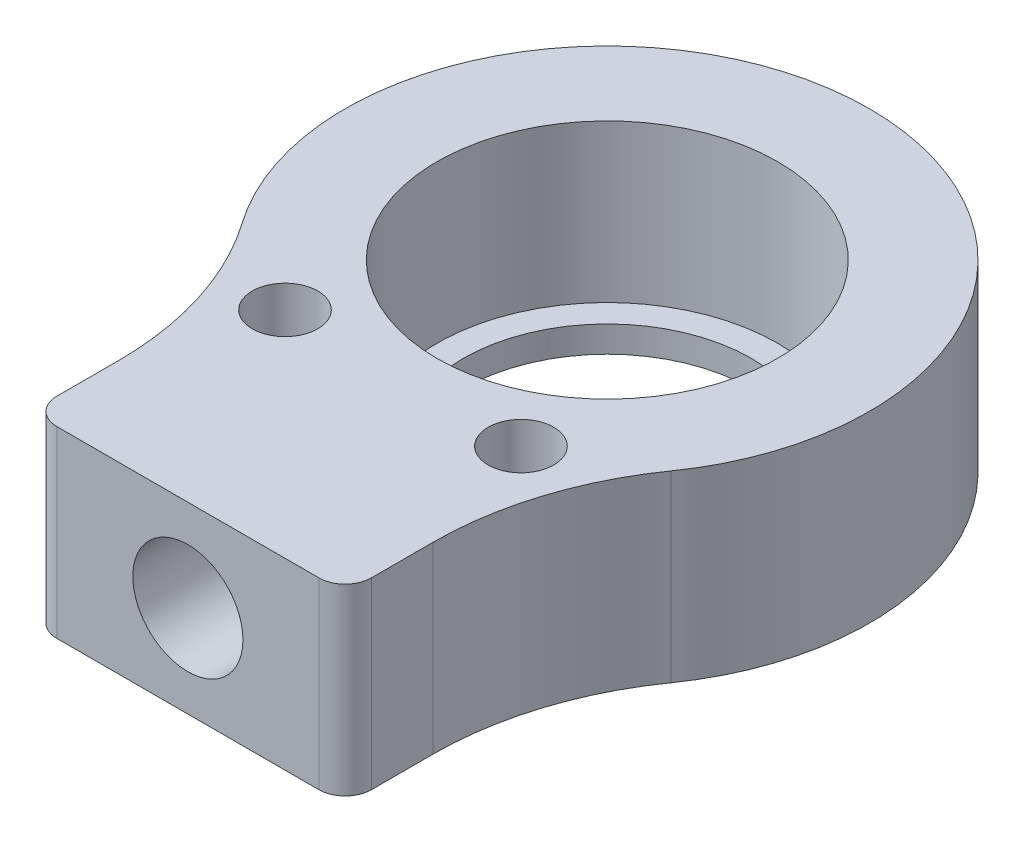
ISO-10303-21;
HEADER;
FILE_DESCRIPTION(('STEP AP214'),'2;1');
FILE_NAME('part.step','',(''),(''),'','','');
FILE_SCHEMA(('AUTOMOTIVE_DESIGN { 1 0 10303 214 1 1 1 1 }'));
ENDSEC;
DATA;
#1=APPLICATION_CONTEXT('core data for automotive mechanical design processes');
#2=APPLICATION_PROTOCOL_DEFINITION('international standard','automotive_design',2000,#1);
#3=PRODUCT_CONTEXT('',#1,'mechanical');
#4=PRODUCT('Part','Part','',(#3));
#5=PRODUCT_RELATED_PRODUCT_CATEGORY('part','',(#4));
#6=PRODUCT_DEFINITION_FORMATION('','',#4);
#7=PRODUCT_DEFINITION_CONTEXT('part definition',#1,'design');
#8=PRODUCT_DEFINITION('design','',#6,#7);
#9=PRODUCT_DEFINITION_SHAPE('','',#8);
#10=(LENGTH_UNIT() NAMED_UNIT(*) SI_UNIT(.MILLI.,.METRE.));
#11=(NAMED_UNIT(*) PLANE_ANGLE_UNIT() SI_UNIT($,.RADIAN.));
#12=(NAMED_UNIT(*) SI_UNIT($,.STERADIAN.) SOLID_ANGLE_UNIT());
#13=UNCERTAINTY_MEASURE_WITH_UNIT(LENGTH_MEASURE(1.E-05),#10,'distance_accuracy_value','');
#14=(GEOMETRIC_REPRESENTATION_CONTEXT(3) GLOBAL_UNCERTAINTY_ASSIGNED_CONTEXT((#13)) GLOBAL_UNIT_ASSIGNED_CONTEXT((#10,
#11,#12)) REPRESENTATION_CONTEXT('',''));
#15=CARTESIAN_POINT('',(0.,0.,0.));
#16=DIRECTION('',(0.,0.,1.));
#17=DIRECTION('',(1.,0.,0.));
#18=AXIS2_PLACEMENT_3D('',#15,#16,#17);
#19=CARTESIAN_POINT('',(0.,7.,0.));
#20=DIRECTION('',(0.,-1.,0.));
#21=DIRECTION('',(0.,0.,-1.));
#22=AXIS2_PLACEMENT_3D('',#19,#20,#21);
#23=CYLINDRICAL_SURFACE('',#22,10.);
#24=CARTESIAN_POINT('',(0.,0.,0.));
#25=DIRECTION('',(0.,1.,0.));
#26=DIRECTION('',(0.,0.,1.));
#27=AXIS2_PLACEMENT_3D('',#24,#25,#26);
#28=CIRCLE('',#27,10.);
#29=CARTESIAN_POINT('',(8.18181818181818,0.,5.74959574576069));
#30=VERTEX_POINT('',#29);
#31=CARTESIAN_POINT('',(-8.18181818181818,0.,5.74959574576069));
#32=VERTEX_POINT('',#31);
#33=EDGE_CURVE('E154',#30,#32,#28,.T.);
#34=ORIENTED_EDGE('',*,*,#33,.T.);
#35=DIRECTION('',(0.,-1.,0.));
#36=VECTOR('',#35,1.);
#37=CARTESIAN_POINT('',(-8.18181818181818,7.,5.74959574576069));
#38=LINE('',#37,#36);
#39=CARTESIAN_POINT('',(-8.18181818181818,7.,5.74959574576069));
#40=VERTEX_POINT('',#39);
#41=EDGE_CURVE('E112',#32,#40,#38,.F.);
#42=ORIENTED_EDGE('',*,*,#41,.T.);
#43=CARTESIAN_POINT('',(0.,7.,0.));
#44=DIRECTION('',(0.,1.,0.));
#45=DIRECTION('',(0.,0.,1.));
#46=AXIS2_PLACEMENT_3D('',#43,#44,#45);
#47=CIRCLE('',#46,10.);
#48=CARTESIAN_POINT('',(8.18181818181818,7.,5.74959574576069));
#49=VERTEX_POINT('',#48);
#50=EDGE_CURVE('E124',#49,#40,#47,.T.);
#51=ORIENTED_EDGE('',*,*,#50,.F.);
#52=DIRECTION('',(0.,-1.,0.));
#53=VECTOR('',#52,1.);
#54=CARTESIAN_POINT('',(8.18181818181818,7.,5.74959574576069));
#55=LINE('',#54,#53);
#56=EDGE_CURVE('E123',#49,#30,#55,.T.);
#57=ORIENTED_EDGE('',*,*,#56,.T.);
#58=EDGE_LOOP('',(#34,#42,#51,#57));
#59=FACE_BOUND('',#58,.T.);
#60=ADVANCED_FACE('F39',(#59),#23,.T.);
#61=CARTESIAN_POINT('',(0.,7.,0.));
#62=DIRECTION('',(0.,-1.,0.));
#63=DIRECTION('',(0.,0.,-1.));
#64=AXIS2_PLACEMENT_3D('',#61,#62,#63);
#65=CYLINDRICAL_SURFACE('',#64,5.5);
#66=CARTESIAN_POINT('',(0.,0.,0.));
#67=DIRECTION('',(0.,1.,0.));
#68=DIRECTION('',(0.,0.,1.));
#69=AXIS2_PLACEMENT_3D('',#66,#67,#68);
#70=CIRCLE('',#69,5.5);
#71=CARTESIAN_POINT('',(0.,0.,5.5));
#72=VERTEX_POINT('',#71);
#73=EDGE_CURVE('E151',#72,#72,#70,.T.);
#74=ORIENTED_EDGE('',*,*,#73,.F.);
#75=EDGE_LOOP('',(#74));
#76=FACE_BOUND('',#75,.T.);
#77=CARTESIAN_POINT('',(0.,1.,0.));
#78=DIRECTION('',(0.,1.,0.));
#79=DIRECTION('',(0.,0.,1.));
#80=AXIS2_PLACEMENT_3D('',#77,#78,#79);
#81=CIRCLE('',#80,5.5);
#82=CARTESIAN_POINT('',(0.,1.,5.5));
#83=VERTEX_POINT('',#82);
#84=EDGE_CURVE('E147',#83,#83,#81,.T.);
#85=ORIENTED_EDGE('',*,*,#84,.T.);
#86=EDGE_LOOP('',(#85));
#87=FACE_BOUND('',#86,.T.);
#88=ADVANCED_FACE('F221',(#76,#87),#65,.F.);
#89=CARTESIAN_POINT('',(0.,7.,0.));
#90=DIRECTION('',(0.,1.,0.));
#91=DIRECTION('',(0.,0.,1.));
#92=AXIS2_PLACEMENT_3D('',#89,#90,#91);
#93=PLANE('',#92);
#94=CARTESIAN_POINT('',(-4.49999999999998,7.,7.79422863405996));
#95=DIRECTION('',(0.,1.,0.));
#96=DIRECTION('',(0.,0.,1.));
#97=AXIS2_PLACEMENT_3D('',#94,#95,#96);
#98=CIRCLE('',#97,1.25);
#99=CARTESIAN_POINT('',(-4.49999999999998,7.,9.04422863405996));
#100=VERTEX_POINT('',#99);
#101=EDGE_CURVE('E180',#100,#100,#98,.T.);
#102=ORIENTED_EDGE('',*,*,#101,.F.);
#103=EDGE_LOOP('',(#102));
#104=FACE_BOUND('',#103,.T.);
#105=CARTESIAN_POINT('',(4.49999999999998,7.,7.79422863405996));
#106=DIRECTION('',(0.,1.,0.));
#107=DIRECTION('',(0.,0.,1.));
#108=AXIS2_PLACEMENT_3D('',#105,#106,#107);
#109=CIRCLE('',#108,1.25);
#110=CARTESIAN_POINT('',(4.49999999999998,7.,9.04422863405996));
#111=VERTEX_POINT('',#110);
#112=EDGE_CURVE('E137',#111,#111,#109,.T.);
#113=ORIENTED_EDGE('',*,*,#112,.F.);
#114=EDGE_LOOP('',(#113));
#115=FACE_BOUND('',#114,.T.);
#116=DIRECTION('',(0.,0.,1.));
#117=VECTOR('',#116,1.);
#118=CARTESIAN_POINT('',(-6.,7.,16.));
#119=LINE('',#118,#117);
#120=CARTESIAN_POINT('',(-6.,7.,12.6491106406735));
#121=VERTEX_POINT('',#120);
#122=CARTESIAN_POINT('',(-6.,7.,15.));
#123=VERTEX_POINT('',#122);
#124=EDGE_CURVE('E122',#121,#123,#119,.T.);
#125=ORIENTED_EDGE('',*,*,#124,.T.);
#126=CARTESIAN_POINT('',(-5.,7.,15.));
#127=DIRECTION('',(0.,1.,0.));
#128=DIRECTION('',(0.,0.,1.));
#129=AXIS2_PLACEMENT_3D('',#126,#127,#128);
#130=CIRCLE('',#129,1.);
#131=CARTESIAN_POINT('',(-5.,7.,16.));
#132=VERTEX_POINT('',#131);
#133=EDGE_CURVE('E47',#123,#132,#130,.T.);
#134=ORIENTED_EDGE('',*,*,#133,.T.);
#135=DIRECTION('',(1.,0.,0.));
#136=VECTOR('',#135,1.);
#137=CARTESIAN_POINT('',(6.,7.,16.));
#138=LINE('',#137,#136);
#139=CARTESIAN_POINT('',(5.,7.,16.));
#140=VERTEX_POINT('',#139);
#141=EDGE_CURVE('E254',#132,#140,#138,.T.);
#142=ORIENTED_EDGE('',*,*,#141,.T.);
#143=CARTESIAN_POINT('',(5.,7.,15.));
#144=DIRECTION('',(0.,1.,0.));
#145=DIRECTION('',(0.,0.,1.));
#146=AXIS2_PLACEMENT_3D('',#143,#144,#145);
#147=CIRCLE('',#146,1.);
#148=CARTESIAN_POINT('',(6.,7.,15.));
#149=VERTEX_POINT('',#148);
#150=EDGE_CURVE('E54',#140,#149,#147,.T.);
#151=ORIENTED_EDGE('',*,*,#150,.T.);
#152=DIRECTION('',(0.,0.,-1.));
#153=VECTOR('',#152,1.);
#154=CARTESIAN_POINT('',(6.,7.,8.));
#155=LINE('',#154,#153);
#156=CARTESIAN_POINT('',(6.,7.,12.6491106406735));
#157=VERTEX_POINT('',#156);
#158=EDGE_CURVE('E140',#149,#157,#155,.T.);
#159=ORIENTED_EDGE('',*,*,#158,.T.);
#160=CARTESIAN_POINT('',(18.,7.,12.6491106406735));
#161=DIRECTION('',(0.,1.,0.));
#162=DIRECTION('',(0.,0.,1.));
#163=AXIS2_PLACEMENT_3D('',#160,#161,#162);
#164=CIRCLE('',#163,12.);
#165=EDGE_CURVE('E169',#157,#49,#164,.F.);
#166=ORIENTED_EDGE('',*,*,#165,.T.);
#167=ORIENTED_EDGE('',*,*,#50,.T.);
#168=CARTESIAN_POINT('',(-18.,7.,12.6491106406735));
#169=DIRECTION('',(0.,1.,0.));
#170=DIRECTION('',(0.,0.,1.));
#171=AXIS2_PLACEMENT_3D('',#168,#169,#170);
#172=CIRCLE('',#171,12.);
#173=EDGE_CURVE('E117',#40,#121,#172,.F.);
#174=ORIENTED_EDGE('',*,*,#173,.T.);
#175=EDGE_LOOP('',(#125,#134,#142,#151,#159,#166,#167,#174));
#176=FACE_BOUND('',#175,.T.);
#177=CARTESIAN_POINT('',(0.,7.,0.));
#178=DIRECTION('',(0.,1.,0.));
#179=DIRECTION('',(0.,0.,1.));
#180=AXIS2_PLACEMENT_3D('',#177,#178,#179);
#181=CIRCLE('',#180,6.5);
#182=CARTESIAN_POINT('',(0.,7.,6.5));
#183=VERTEX_POINT('',#182);
#184=EDGE_CURVE('E148',#183,#183,#181,.T.);
#185=ORIENTED_EDGE('',*,*,#184,.F.);
#186=EDGE_LOOP('',(#185));
#187=FACE_BOUND('',#186,.T.);
#188=ADVANCED_FACE('F227',(#104,#115,#176,#187),#93,.T.);
#189=CARTESIAN_POINT('',(0.,0.,0.));
#190=DIRECTION('',(0.,1.,0.));
#191=DIRECTION('',(0.,0.,1.));
#192=AXIS2_PLACEMENT_3D('',#189,#190,#191);
#193=PLANE('',#192);
#194=CARTESIAN_POINT('',(-4.49999999999998,0.,7.79422863405996));
#195=DIRECTION('',(0.,1.,0.));
#196=DIRECTION('',(0.,0.,1.));
#197=AXIS2_PLACEMENT_3D('',#194,#195,#196);
#198=CIRCLE('',#197,1.25);
#199=CARTESIAN_POINT('',(-4.49999999999998,0.,9.04422863405996));
#200=VERTEX_POINT('',#199);
#201=EDGE_CURVE('E266',#200,#200,#198,.T.);
#202=ORIENTED_EDGE('',*,*,#201,.T.);
#203=EDGE_LOOP('',(#202));
#204=FACE_BOUND('',#203,.T.);
#205=CARTESIAN_POINT('',(4.49999999999998,0.,7.79422863405996));
#206=DIRECTION('',(0.,1.,0.));
#207=DIRECTION('',(0.,0.,1.));
#208=AXIS2_PLACEMENT_3D('',#205,#206,#207);
#209=CIRCLE('',#208,1.25);
#210=CARTESIAN_POINT('',(4.49999999999998,0.,9.04422863405996));
#211=VERTEX_POINT('',#210);
#212=EDGE_CURVE('E131',#211,#211,#209,.T.);
#213=ORIENTED_EDGE('',*,*,#212,.T.);
#214=EDGE_LOOP('',(#213));
#215=FACE_BOUND('',#214,.T.);
#216=DIRECTION('',(1.,0.,0.));
#217=VECTOR('',#216,1.);
#218=CARTESIAN_POINT('',(6.,0.,16.));
#219=LINE('',#218,#217);
#220=CARTESIAN_POINT('',(-5.,0.,16.));
#221=VERTEX_POINT('',#220);
#222=CARTESIAN_POINT('',(5.,0.,16.));
#223=VERTEX_POINT('',#222);
#224=EDGE_CURVE('E130',#221,#223,#219,.T.);
#225=ORIENTED_EDGE('',*,*,#224,.F.);
#226=CARTESIAN_POINT('',(-5.,0.,15.));
#227=DIRECTION('',(0.,1.,0.));
#228=DIRECTION('',(0.,0.,1.));
#229=AXIS2_PLACEMENT_3D('',#226,#227,#228);
#230=CIRCLE('',#229,1.);
#231=CARTESIAN_POINT('',(-6.,0.,15.));
#232=VERTEX_POINT('',#231);
#233=EDGE_CURVE('E129',#221,#232,#230,.F.);
#234=ORIENTED_EDGE('',*,*,#233,.T.);
#235=DIRECTION('',(0.,0.,1.));
#236=VECTOR('',#235,1.);
#237=CARTESIAN_POINT('',(-6.,0.,16.));
#238=LINE('',#237,#236);
#239=CARTESIAN_POINT('',(-6.,0.,12.6491106406735));
#240=VERTEX_POINT('',#239);
#241=EDGE_CURVE('E121',#240,#232,#238,.T.);
#242=ORIENTED_EDGE('',*,*,#241,.F.);
#243=CARTESIAN_POINT('',(-18.,0.,12.6491106406735));
#244=DIRECTION('',(0.,1.,0.));
#245=DIRECTION('',(0.,0.,1.));
#246=AXIS2_PLACEMENT_3D('',#243,#244,#245);
#247=CIRCLE('',#246,12.);
#248=EDGE_CURVE('E107',#240,#32,#247,.T.);
#249=ORIENTED_EDGE('',*,*,#248,.T.);
#250=ORIENTED_EDGE('',*,*,#33,.F.);
#251=CARTESIAN_POINT('',(18.,0.,12.6491106406735));
#252=DIRECTION('',(0.,1.,0.));
#253=DIRECTION('',(0.,0.,1.));
#254=AXIS2_PLACEMENT_3D('',#251,#252,#253);
#255=CIRCLE('',#254,12.);
#256=CARTESIAN_POINT('',(6.,0.,12.6491106406735));
#257=VERTEX_POINT('',#256);
#258=EDGE_CURVE('E166',#30,#257,#255,.T.);
#259=ORIENTED_EDGE('',*,*,#258,.T.);
#260=DIRECTION('',(0.,0.,-1.));
#261=VECTOR('',#260,1.);
#262=CARTESIAN_POINT('',(6.,0.,8.));
#263=LINE('',#262,#261);
#264=CARTESIAN_POINT('',(6.,0.,15.));
#265=VERTEX_POINT('',#264);
#266=EDGE_CURVE('E134',#265,#257,#263,.T.);
#267=ORIENTED_EDGE('',*,*,#266,.F.);
#268=CARTESIAN_POINT('',(5.,0.,15.));
#269=DIRECTION('',(0.,1.,0.));
#270=DIRECTION('',(0.,0.,1.));
#271=AXIS2_PLACEMENT_3D('',#268,#269,#270);
#272=CIRCLE('',#271,1.);
#273=EDGE_CURVE('E251',#265,#223,#272,.F.);
#274=ORIENTED_EDGE('',*,*,#273,.T.);
#275=EDGE_LOOP('',(#225,#234,#242,#249,#250,#259,#267,#274));
#276=FACE_BOUND('',#275,.T.);
#277=ORIENTED_EDGE('',*,*,#73,.T.);
#278=EDGE_LOOP('',(#277));
#279=FACE_BOUND('',#278,.T.);
#280=ADVANCED_FACE('F127',(#204,#215,#276,#279),#193,.F.);
#281=CARTESIAN_POINT('',(0.,1.,0.));
#282=DIRECTION('',(0.,1.,0.));
#283=DIRECTION('',(0.,0.,1.));
#284=AXIS2_PLACEMENT_3D('',#281,#282,#283);
#285=CYLINDRICAL_SURFACE('',#284,6.5);
#286=CARTESIAN_POINT('',(0.,1.40000000000001,6.5));
#287=CARTESIAN_POINT('',(0.114780152678519,1.40000013326098,6.49999984762594));
#288=CARTESIAN_POINT('',(0.229562646212126,1.409441164251,6.49693136614676));
#289=CARTESIAN_POINT('',(0.455758735968135,1.44684858951266,6.48499201245018));
#290=CARTESIAN_POINT('',(0.567171774928906,1.47481803079874,6.47612018587026));
#291=CARTESIAN_POINT('',(0.783334943692375,1.54823192886979,6.45354073761235));
#292=CARTESIAN_POINT('',(0.88809548762785,1.59364824624093,6.43984090576822));
#293=CARTESIAN_POINT('',(1.08851351392821,1.70054322424069,6.40901183916854));
#294=CARTESIAN_POINT('',(1.18416937216912,1.7620247433346,6.39188199424108));
#295=CARTESIAN_POINT('',(1.36679767568749,1.90142339988139,6.35537555243329));
#296=CARTESIAN_POINT('',(1.45343019593023,1.97977234832067,6.33594753880125));
#297=CARTESIAN_POINT('',(1.61258241008023,2.14976310716213,6.29732467015338));
#298=CARTESIAN_POINT('',(1.68509924230959,2.24140760641673,6.27812986315358));
#299=CARTESIAN_POINT('',(1.81585313888027,2.43838942073292,6.24158803844324));
#300=CARTESIAN_POINT('',(1.87365695616512,2.54402713757865,6.22430408492323));
#301=CARTESIAN_POINT('',(1.97053521369595,2.76417306129457,6.19431848653863));
#302=CARTESIAN_POINT('',(2.00961497600927,2.87867873680156,6.18161553983706));
#303=CARTESIAN_POINT('',(2.06667622660957,3.10945912010126,6.16276983931889));
#304=CARTESIAN_POINT('',(2.08529153012779,3.22556060612285,6.15643057256346));
#305=CARTESIAN_POINT('',(2.10287625070445,3.45939869106894,6.15044761140109));
#306=CARTESIAN_POINT('',(2.10185130852799,3.57713481081235,6.15080199454799));
#307=CARTESIAN_POINT('',(2.08067854494972,3.80557683778153,6.15799345504348));
#308=CARTESIAN_POINT('',(2.06134700904492,3.91636860192314,6.16455379741828));
#309=CARTESIAN_POINT('',(2.00543737492301,4.13304303095938,6.1829667959278));
#310=CARTESIAN_POINT('',(1.96885732834051,4.23892513978245,6.1948200499337));
#311=CARTESIAN_POINT('',(1.87893383724713,4.44467403774003,6.22268788340783));
#312=CARTESIAN_POINT('',(1.82534134925148,4.54442333940889,6.23876362994827));
#313=CARTESIAN_POINT('',(1.70308717246323,4.73377598706393,6.27323829474391));
#314=CARTESIAN_POINT('',(1.63442134649959,4.82337653727212,6.29163785022376));
#315=CARTESIAN_POINT('',(1.48000669369172,4.99448929367817,6.32978643852367));
#316=CARTESIAN_POINT('',(1.39358721886844,5.07539256490432,6.34955748594388));
#317=CARTESIAN_POINT('',(1.20816261133915,5.2217118952384,6.38743186866717));
#318=CARTESIAN_POINT('',(1.10915641457954,5.28712664364106,6.40553506275021));
#319=CARTESIAN_POINT('',(0.90013637231045,5.40106308615933,6.43824721057395));
#320=CARTESIAN_POINT('',(0.790033092396682,5.44943059952337,6.45282391669772));
#321=CARTESIAN_POINT('',(0.562670821437446,5.52677263079626,6.47660732137455));
#322=CARTESIAN_POINT('',(0.445414172802397,5.55575346018229,6.48581576747844));
#323=CARTESIAN_POINT('',(0.212235568694098,5.59244144909878,6.49753974554395));
#324=CARTESIAN_POINT('',(0.0964560310383862,5.60097218491271,6.50031423039758));
#325=CARTESIAN_POINT('',(-0.134897611158433,5.59885188835043,6.49962893282386));
#326=CARTESIAN_POINT('',(-0.250471745156622,5.58820387387449,6.49617013124436));
#327=CARTESIAN_POINT('',(-0.474897398486163,5.5486849183147,6.48357748396053));
#328=CARTESIAN_POINT('',(-0.583846122334335,5.52031175928149,6.47459876244501));
#329=CARTESIAN_POINT('',(-0.795399868811155,5.44676279221651,6.4520280403984));
#330=CARTESIAN_POINT('',(-0.898004091655652,5.4015848708016,6.43843545964271));
#331=CARTESIAN_POINT('',(-1.09685611026068,5.29443202360545,6.40759659592119));
#332=CARTESIAN_POINT('',(-1.19287645758088,5.23205985285184,6.39026632979125));
#333=CARTESIAN_POINT('',(-1.37335993471931,5.09276056080126,6.35392571159687));
#334=CARTESIAN_POINT('',(-1.45781971658138,5.01582923845727,6.33491487544933));
#335=CARTESIAN_POINT('',(-1.61651818338125,4.84572097553264,6.29633442103443));
#336=CARTESIAN_POINT('',(-1.69016938349651,4.75199225632221,6.27677542522803));
#337=CARTESIAN_POINT('',(-1.82076055180556,4.553082794392,6.24014795835414));
#338=CARTESIAN_POINT('',(-1.87770059960644,4.44790210622935,6.22307947542277));
#339=CARTESIAN_POINT('',(-1.97293988416011,4.22916916026276,6.19354517835395));
#340=CARTESIAN_POINT('',(-2.01129547208989,4.11564342719124,6.18106547836716));
#341=CARTESIAN_POINT('',(-2.06819042623143,3.88325337229309,6.16226449334382));
#342=CARTESIAN_POINT('',(-2.08673801486372,3.76439128698659,6.15594065306915));
#343=CARTESIAN_POINT('',(-2.10287398644435,3.53087864742954,6.15044597744329));
#344=CARTESIAN_POINT('',(-2.10143170730169,3.41630207378392,6.1509443099754));
#345=CARTESIAN_POINT('',(-2.07999175555091,3.18911228980186,6.15822697913326));
#346=CARTESIAN_POINT('',(-2.05999506389632,3.07649897599049,6.16501098344171));
#347=CARTESIAN_POINT('',(-2.0026819067383,2.85829718456684,6.18386170119516));
#348=CARTESIAN_POINT('',(-1.96566104718839,2.75262265601691,6.19583805979404));
#349=CARTESIAN_POINT('',(-1.87558632651301,2.54890196388366,6.22369569223963));
#350=CARTESIAN_POINT('',(-1.82252904910128,2.45085743134323,6.23957779800492));
#351=CARTESIAN_POINT('',(-1.69932067816034,2.2607816701388,6.27427773405697));
#352=CARTESIAN_POINT('',(-1.62855266631232,2.16916762849268,6.29318990404038));
#353=CARTESIAN_POINT('',(-1.47299576999185,1.99880177489966,6.33140503172638));
#354=CARTESIAN_POINT('',(-1.38820303038322,1.92005351137916,6.35070809559453));
#355=CARTESIAN_POINT('',(-1.20335860583315,1.77482546498718,6.38835851966061));
#356=CARTESIAN_POINT('',(-1.10286967112842,1.70888514525647,6.40664701425018));
#357=CARTESIAN_POINT('',(-0.891645850173478,1.59491304176281,6.43943829822981));
#358=CARTESIAN_POINT('',(-0.780914313486266,1.54687542907176,6.45394231934155));
#359=CARTESIAN_POINT('',(-0.559731443724434,1.47283194592696,6.4767469097158));
#360=CARTESIAN_POINT('',(-0.449724427071781,1.44560293582375,6.48538779223929));
#361=CARTESIAN_POINT('',(-0.226478517537957,1.40918903792172,6.49701374152978));
#362=CARTESIAN_POINT('',(-0.113240398005008,1.39999986852671,6.50000015032999));
#363=CARTESIAN_POINT('',(0.,1.40000000000001,6.5));
#364=B_SPLINE_CURVE_WITH_KNOTS('',3,(#286,#287,#288,#289,#290,#291,#292,#293,#294,#295,#296,
#297,#298,#299,#300,#301,#302,#303,#304,#305,#306,#307,#308,#309,#310,#311,#312,#313,#314,#315,
#316,#317,#318,#319,#320,#321,#322,#323,#324,#325,#326,#327,#328,#329,#330,#331,#332,#333,#334,
#335,#336,#337,#338,#339,#340,#341,#342,#343,#344,#345,#346,#347,#348,#349,#350,#351,#352,#353,
#354,#355,#356,#357,#358,#359,#360,#361,#362,#363),.UNSPECIFIED.,.T.,.F.,(4,2,2,2,2,2,2,2,2,2,2,
2,2,2,2,2,2,2,2,2,2,2,2,2,2,2,2,2,2,2,2,2,2,2,2,2,2,2,4),(0.,0.343923981095443,
0.687904534857072,1.03133260886579,1.37482183034691,1.72845644393133,2.08216267547617,
2.44531833325059,2.80837070746088,3.1598310119415,3.51119037698752,3.84758565907627,
4.18401894896812,4.52562389865707,4.86732272596722,5.22571361317305,5.58413481812309,
5.94571918962464,6.30718578731834,6.65383086592769,7.00042140245964,7.33769086053151,
7.67500274828451,8.02087649799562,8.36685020225925,8.7275383796796,9.08822483885798,
9.44781068404831,9.80724720488732,10.1493177330618,10.4913701773346,10.8276953457347,
11.1640922130562,11.5144204767654,11.8648451997129,12.2278019086183,12.5906403392817,
12.9300312044731,13.2693415085097),.UNSPECIFIED.);
#365=CARTESIAN_POINT('',(0.,1.40000000000001,6.5));
#366=VERTEX_POINT('',#365);
#367=EDGE_CURVE('E172',#366,#366,#364,.T.);
#368=ORIENTED_EDGE('',*,*,#367,.T.);
#369=EDGE_LOOP('',(#368));
#370=FACE_BOUND('',#369,.T.);
#371=CARTESIAN_POINT('',(0.,1.,0.));
#372=DIRECTION('',(0.,1.,0.));
#373=DIRECTION('',(0.,0.,1.));
#374=AXIS2_PLACEMENT_3D('',#371,#372,#373);
#375=CIRCLE('',#374,6.5);
#376=CARTESIAN_POINT('',(0.,1.,6.5));
#377=VERTEX_POINT('',#376);
#378=EDGE_CURVE('E144',#377,#377,#375,.T.);
#379=ORIENTED_EDGE('',*,*,#378,.F.);
#380=EDGE_LOOP('',(#379));
#381=FACE_BOUND('',#380,.T.);
#382=ORIENTED_EDGE('',*,*,#184,.T.);
#383=EDGE_LOOP('',(#382));
#384=FACE_BOUND('',#383,.T.);
#385=ADVANCED_FACE('F183',(#370,#381,#384),#285,.F.);
#386=CARTESIAN_POINT('',(0.,1.,0.));
#387=DIRECTION('',(0.,1.,0.));
#388=DIRECTION('',(0.,0.,1.));
#389=AXIS2_PLACEMENT_3D('',#386,#387,#388);
#390=PLANE('',#389);
#391=ORIENTED_EDGE('',*,*,#84,.F.);
#392=EDGE_LOOP('',(#391));
#393=FACE_BOUND('',#392,.T.);
#394=ORIENTED_EDGE('',*,*,#378,.T.);
#395=EDGE_LOOP('',(#394));
#396=FACE_BOUND('',#395,.T.);
#397=ADVANCED_FACE('F211',(#393,#396),#390,.T.);
#398=CARTESIAN_POINT('',(-6.,7.,16.));
#399=DIRECTION('',(1.,0.,0.));
#400=DIRECTION('',(0.,0.,-1.));
#401=AXIS2_PLACEMENT_3D('',#398,#399,#400);
#402=PLANE('',#401);
#403=ORIENTED_EDGE('',*,*,#241,.T.);
#404=DIRECTION('',(0.,-1.,0.));
#405=VECTOR('',#404,1.);
#406=CARTESIAN_POINT('',(-6.,7.,15.));
#407=LINE('',#406,#405);
#408=EDGE_CURVE('E62',#232,#123,#407,.F.);
#409=ORIENTED_EDGE('',*,*,#408,.T.);
#410=ORIENTED_EDGE('',*,*,#124,.F.);
#411=DIRECTION('',(0.,1.,0.));
#412=VECTOR('',#411,1.);
#413=CARTESIAN_POINT('',(-6.,0.,12.6491106406735));
#414=LINE('',#413,#412);
#415=EDGE_CURVE('E111',#121,#240,#414,.F.);
#416=ORIENTED_EDGE('',*,*,#415,.T.);
#417=EDGE_LOOP('',(#403,#409,#410,#416));
#418=FACE_BOUND('',#417,.T.);
#419=ADVANCED_FACE('F120',(#418),#402,.F.);
#420=CARTESIAN_POINT('',(6.,7.,16.));
#421=DIRECTION('',(0.,0.,-1.));
#422=DIRECTION('',(-1.,0.,0.));
#423=AXIS2_PLACEMENT_3D('',#420,#421,#422);
#424=PLANE('',#423);
#425=CARTESIAN_POINT('',(0.,3.5,16.));
#426=DIRECTION('',(0.,0.,1.));
#427=DIRECTION('',(1.,0.,0.));
#428=AXIS2_PLACEMENT_3D('',#425,#426,#427);
#429=CIRCLE('',#428,2.09999999999999);
#430=CARTESIAN_POINT('',(2.09999999999999,3.5,16.));
#431=VERTEX_POINT('',#430);
#432=EDGE_CURVE('E181',#431,#431,#429,.T.);
#433=ORIENTED_EDGE('',*,*,#432,.F.);
#434=EDGE_LOOP('',(#433));
#435=FACE_BOUND('',#434,.T.);
#436=ORIENTED_EDGE('',*,*,#141,.F.);
#437=DIRECTION('',(0.,-1.,0.));
#438=VECTOR('',#437,1.);
#439=CARTESIAN_POINT('',(-5.,7.,16.));
#440=LINE('',#439,#438);
#441=EDGE_CURVE('E245',#132,#221,#440,.T.);
#442=ORIENTED_EDGE('',*,*,#441,.T.);
#443=ORIENTED_EDGE('',*,*,#224,.T.);
#444=DIRECTION('',(0.,-1.,0.));
#445=VECTOR('',#444,1.);
#446=CARTESIAN_POINT('',(5.,7.,16.));
#447=LINE('',#446,#445);
#448=EDGE_CURVE('E171',#223,#140,#447,.F.);
#449=ORIENTED_EDGE('',*,*,#448,.T.);
#450=EDGE_LOOP('',(#436,#442,#443,#449));
#451=FACE_BOUND('',#450,.T.);
#452=ADVANCED_FACE('F205',(#435,#451),#424,.F.);
#453=CARTESIAN_POINT('',(6.,7.,8.));
#454=DIRECTION('',(-1.,0.,0.));
#455=DIRECTION('',(0.,0.,1.));
#456=AXIS2_PLACEMENT_3D('',#453,#454,#455);
#457=PLANE('',#456);
#458=ORIENTED_EDGE('',*,*,#158,.F.);
#459=DIRECTION('',(0.,-1.,0.));
#460=VECTOR('',#459,1.);
#461=CARTESIAN_POINT('',(6.,7.,15.));
#462=LINE('',#461,#460);
#463=EDGE_CURVE('E11',#149,#265,#462,.T.);
#464=ORIENTED_EDGE('',*,*,#463,.T.);
#465=ORIENTED_EDGE('',*,*,#266,.T.);
#466=DIRECTION('',(0.,1.,0.));
#467=VECTOR('',#466,1.);
#468=CARTESIAN_POINT('',(6.,7.,12.6491106406735));
#469=LINE('',#468,#467);
#470=EDGE_CURVE('E118',#257,#157,#469,.T.);
#471=ORIENTED_EDGE('',*,*,#470,.T.);
#472=EDGE_LOOP('',(#458,#464,#465,#471));
#473=FACE_BOUND('',#472,.T.);
#474=ADVANCED_FACE('F202',(#473),#457,.F.);
#475=CARTESIAN_POINT('',(-18.,7.,12.6491106406735));
#476=DIRECTION('',(0.,-1.,0.));
#477=DIRECTION('',(0.,0.,-1.));
#478=AXIS2_PLACEMENT_3D('',#475,#476,#477);
#479=CYLINDRICAL_SURFACE('',#478,12.);
#480=ORIENTED_EDGE('',*,*,#173,.F.);
#481=ORIENTED_EDGE('',*,*,#41,.F.);
#482=ORIENTED_EDGE('',*,*,#248,.F.);
#483=ORIENTED_EDGE('',*,*,#415,.F.);
#484=EDGE_LOOP('',(#480,#481,#482,#483));
#485=FACE_BOUND('',#484,.T.);
#486=ADVANCED_FACE('F110',(#485),#479,.F.);
#487=CARTESIAN_POINT('',(18.,7.,12.6491106406735));
#488=DIRECTION('',(0.,-1.,0.));
#489=DIRECTION('',(0.,0.,-1.));
#490=AXIS2_PLACEMENT_3D('',#487,#488,#489);
#491=CYLINDRICAL_SURFACE('',#490,12.);
#492=ORIENTED_EDGE('',*,*,#165,.F.);
#493=ORIENTED_EDGE('',*,*,#470,.F.);
#494=ORIENTED_EDGE('',*,*,#258,.F.);
#495=ORIENTED_EDGE('',*,*,#56,.F.);
#496=EDGE_LOOP('',(#492,#493,#494,#495));
#497=FACE_BOUND('',#496,.T.);
#498=ADVANCED_FACE('F200',(#497),#491,.F.);
#499=CARTESIAN_POINT('',(4.49999999999998,7.,7.79422863405996));
#500=DIRECTION('',(0.,1.,0.));
#501=DIRECTION('',(0.,0.,1.));
#502=AXIS2_PLACEMENT_3D('',#499,#500,#501);
#503=CYLINDRICAL_SURFACE('',#502,1.25);
#504=ORIENTED_EDGE('',*,*,#212,.F.);
#505=EDGE_LOOP('',(#504));
#506=FACE_BOUND('',#505,.T.);
#507=ORIENTED_EDGE('',*,*,#112,.T.);
#508=EDGE_LOOP('',(#507));
#509=FACE_BOUND('',#508,.T.);
#510=ADVANCED_FACE('F196',(#506,#509),#503,.F.);
#511=CARTESIAN_POINT('',(-4.49999999999998,7.,7.79422863405996));
#512=DIRECTION('',(0.,1.,0.));
#513=DIRECTION('',(0.,0.,1.));
#514=AXIS2_PLACEMENT_3D('',#511,#512,#513);
#515=CYLINDRICAL_SURFACE('',#514,1.25);
#516=ORIENTED_EDGE('',*,*,#201,.F.);
#517=EDGE_LOOP('',(#516));
#518=FACE_BOUND('',#517,.T.);
#519=ORIENTED_EDGE('',*,*,#101,.T.);
#520=EDGE_LOOP('',(#519));
#521=FACE_BOUND('',#520,.T.);
#522=ADVANCED_FACE('F192',(#518,#521),#515,.F.);
#523=CARTESIAN_POINT('',(0.,3.5,16.));
#524=DIRECTION('',(0.,0.,1.));
#525=DIRECTION('',(1.,0.,0.));
#526=AXIS2_PLACEMENT_3D('',#523,#524,#525);
#527=CYLINDRICAL_SURFACE('',#526,2.09999999999999);
#528=ORIENTED_EDGE('',*,*,#432,.T.);
#529=EDGE_LOOP('',(#528));
#530=FACE_BOUND('',#529,.T.);
#531=ORIENTED_EDGE('',*,*,#367,.F.);
#532=EDGE_LOOP('',(#531));
#533=FACE_BOUND('',#532,.T.);
#534=ADVANCED_FACE('F187',(#530,#533),#527,.F.);
#535=CARTESIAN_POINT('',(-5.,7.,15.));
#536=DIRECTION('',(0.,-1.,0.));
#537=DIRECTION('',(0.,0.,-1.));
#538=AXIS2_PLACEMENT_3D('',#535,#536,#537);
#539=CYLINDRICAL_SURFACE('',#538,1.);
#540=ORIENTED_EDGE('',*,*,#133,.F.);
#541=ORIENTED_EDGE('',*,*,#408,.F.);
#542=ORIENTED_EDGE('',*,*,#233,.F.);
#543=ORIENTED_EDGE('',*,*,#441,.F.);
#544=EDGE_LOOP('',(#540,#541,#542,#543));
#545=FACE_BOUND('',#544,.T.);
#546=ADVANCED_FACE('F191',(#545),#539,.T.);
#547=CARTESIAN_POINT('',(5.,7.,15.));
#548=DIRECTION('',(0.,-1.,0.));
#549=DIRECTION('',(0.,0.,-1.));
#550=AXIS2_PLACEMENT_3D('',#547,#548,#549);
#551=CYLINDRICAL_SURFACE('',#550,1.);
#552=ORIENTED_EDGE('',*,*,#150,.F.);
#553=ORIENTED_EDGE('',*,*,#448,.F.);
#554=ORIENTED_EDGE('',*,*,#273,.F.);
#555=ORIENTED_EDGE('',*,*,#463,.F.);
#556=EDGE_LOOP('',(#552,#553,#554,#555));
#557=FACE_BOUND('',#556,.T.);
#558=ADVANCED_FACE('F41',(#557),#551,.T.);
#559=CLOSED_SHELL('',(#60,#88,#188,#280,#385,#397,#419,#452,#474,#486,#498,#510,#522,#534,#546,#558));
#560=MANIFOLD_SOLID_BREP('B2',#559);
#561=ADVANCED_BREP_SHAPE_REPRESENTATION('',(#18,#560),#14);
#562=SHAPE_DEFINITION_REPRESENTATION(#9,#561);
ENDSEC;
END-ISO-10303-21;
